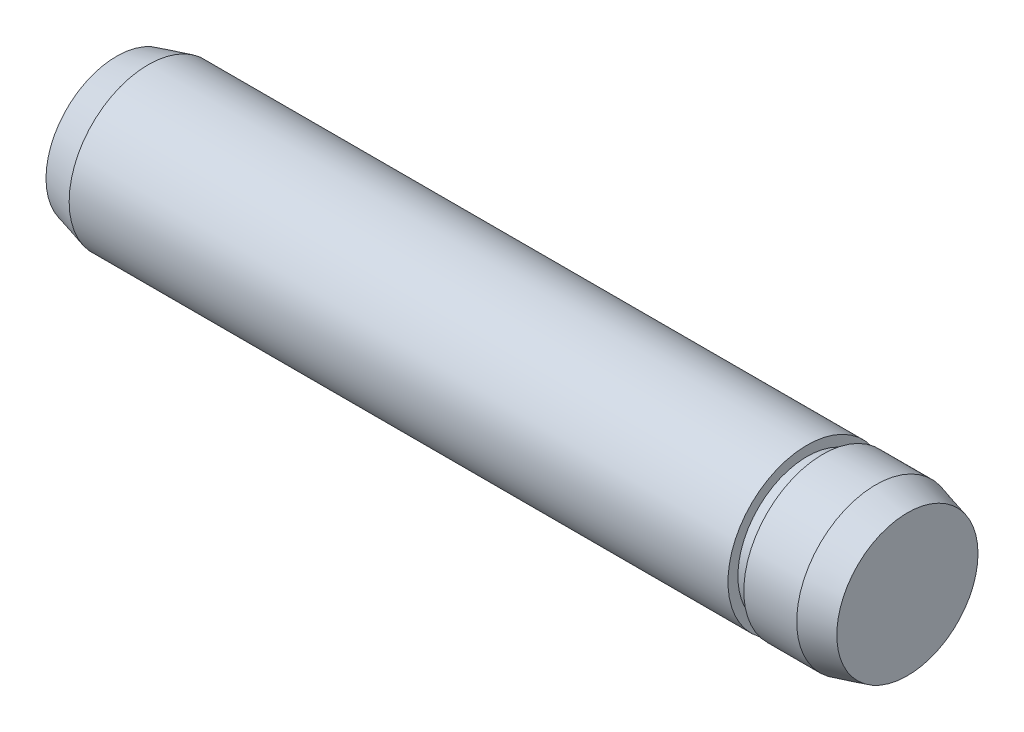
ISO-10303-21;
HEADER;
FILE_DESCRIPTION(('STEP AP214'),'2;1');
FILE_NAME('part.step','',(''),(''),'','','');
FILE_SCHEMA(('AUTOMOTIVE_DESIGN { 1 0 10303 214 1 1 1 1 }'));
ENDSEC;
DATA;
#1=APPLICATION_CONTEXT('core data for automotive mechanical design processes');
#2=APPLICATION_PROTOCOL_DEFINITION('international standard','automotive_design',2000,#1);
#3=PRODUCT_CONTEXT('',#1,'mechanical');
#4=PRODUCT('Part','Part','',(#3));
#5=PRODUCT_RELATED_PRODUCT_CATEGORY('part','',(#4));
#6=PRODUCT_DEFINITION_FORMATION('','',#4);
#7=PRODUCT_DEFINITION_CONTEXT('part definition',#1,'design');
#8=PRODUCT_DEFINITION('design','',#6,#7);
#9=PRODUCT_DEFINITION_SHAPE('','',#8);
#10=(LENGTH_UNIT() NAMED_UNIT(*) SI_UNIT(.MILLI.,.METRE.));
#11=(NAMED_UNIT(*) PLANE_ANGLE_UNIT() SI_UNIT($,.RADIAN.));
#12=(NAMED_UNIT(*) SI_UNIT($,.STERADIAN.) SOLID_ANGLE_UNIT());
#13=UNCERTAINTY_MEASURE_WITH_UNIT(LENGTH_MEASURE(1.E-05),#10,'distance_accuracy_value','');
#14=(GEOMETRIC_REPRESENTATION_CONTEXT(3) GLOBAL_UNCERTAINTY_ASSIGNED_CONTEXT((#13)) GLOBAL_UNIT_ASSIGNED_CONTEXT((#10,
#11,#12)) REPRESENTATION_CONTEXT('',''));
#15=CARTESIAN_POINT('',(0.,0.,0.));
#16=DIRECTION('',(0.,0.,1.));
#17=DIRECTION('',(1.,0.,0.));
#18=AXIS2_PLACEMENT_3D('',#15,#16,#17);
#19=CARTESIAN_POINT('',(-18.4,0.,0.));
#20=DIRECTION('',(1.,0.,0.));
#21=DIRECTION('',(0.,0.,-1.));
#22=AXIS2_PLACEMENT_3D('',#19,#20,#21);
#23=CYLINDRICAL_SURFACE('',#22,4.);
#24=CARTESIAN_POINT('',(15.72499999,0.,0.));
#25=DIRECTION('',(1.,0.,0.));
#26=DIRECTION('',(0.,0.,-1.));
#27=AXIS2_PLACEMENT_3D('',#24,#25,#26);
#28=CIRCLE('',#27,4.);
#29=CARTESIAN_POINT('',(15.72499999,0.,-4.));
#30=VERTEX_POINT('',#29);
#31=EDGE_CURVE('E64',#30,#30,#28,.T.);
#32=ORIENTED_EDGE('',*,*,#31,.T.);
#33=EDGE_LOOP('',(#32));
#34=FACE_BOUND('',#33,.T.);
#35=CARTESIAN_POINT('',(18.4,0.,0.));
#36=DIRECTION('',(1.,0.,0.));
#37=DIRECTION('',(0.,0.,-1.));
#38=AXIS2_PLACEMENT_3D('',#35,#36,#37);
#39=CIRCLE('',#38,4.);
#40=CARTESIAN_POINT('',(18.4,0.,-4.));
#41=VERTEX_POINT('',#40);
#42=EDGE_CURVE('E10',#41,#41,#39,.T.);
#43=ORIENTED_EDGE('',*,*,#42,.F.);
#44=EDGE_LOOP('',(#43));
#45=FACE_BOUND('',#44,.T.);
#46=ADVANCED_FACE('F38',(#34,#45),#23,.T.);
#47=CARTESIAN_POINT('',(18.4,0.,0.));
#48=DIRECTION('',(-1.,0.,0.));
#49=DIRECTION('',(0.,0.,-1.));
#50=AXIS2_PLACEMENT_3D('',#47,#48,#49);
#51=CONICAL_SURFACE('',#50,4.,0.26179938779915);
#52=CARTESIAN_POINT('',(20.,0.,0.));
#53=DIRECTION('',(1.,0.,0.));
#54=DIRECTION('',(0.,0.,-1.));
#55=AXIS2_PLACEMENT_3D('',#52,#53,#54);
#56=CIRCLE('',#55,3.5712812921102);
#57=CARTESIAN_POINT('',(20.,0.,-3.5712812921102));
#58=VERTEX_POINT('',#57);
#59=EDGE_CURVE('E45',#58,#58,#56,.T.);
#60=ORIENTED_EDGE('',*,*,#59,.F.);
#61=EDGE_LOOP('',(#60));
#62=FACE_BOUND('',#61,.T.);
#63=ORIENTED_EDGE('',*,*,#42,.T.);
#64=EDGE_LOOP('',(#63));
#65=FACE_BOUND('',#64,.T.);
#66=ADVANCED_FACE('F99',(#62,#65),#51,.T.);
#67=CARTESIAN_POINT('',(20.,0.,0.));
#68=DIRECTION('',(1.,0.,0.));
#69=DIRECTION('',(0.,0.,-1.));
#70=AXIS2_PLACEMENT_3D('',#67,#68,#69);
#71=PLANE('',#70);
#72=ORIENTED_EDGE('',*,*,#59,.T.);
#73=EDGE_LOOP('',(#72));
#74=FACE_BOUND('',#73,.T.);
#75=ADVANCED_FACE('F94',(#74),#71,.T.);
#76=CARTESIAN_POINT('',(15.72499999,0.,0.));
#77=DIRECTION('',(1.,0.,0.));
#78=DIRECTION('',(0.,0.,-1.));
#79=AXIS2_PLACEMENT_3D('',#76,#77,#78);
#80=PLANE('',#79);
#81=ORIENTED_EDGE('',*,*,#31,.F.);
#82=EDGE_LOOP('',(#81));
#83=FACE_BOUND('',#82,.T.);
#84=CARTESIAN_POINT('',(15.72499999,0.,0.));
#85=DIRECTION('',(1.,0.,0.));
#86=DIRECTION('',(0.,0.,-1.));
#87=AXIS2_PLACEMENT_3D('',#84,#85,#86);
#88=CIRCLE('',#87,3.5);
#89=CARTESIAN_POINT('',(15.72499999,0.,-3.5));
#90=VERTEX_POINT('',#89);
#91=EDGE_CURVE('E68',#90,#90,#88,.T.);
#92=ORIENTED_EDGE('',*,*,#91,.T.);
#93=EDGE_LOOP('',(#92));
#94=FACE_BOUND('',#93,.T.);
#95=ADVANCED_FACE('F78',(#83,#94),#80,.F.);
#96=CARTESIAN_POINT('',(14.92499999,0.,0.));
#97=DIRECTION('',(1.,0.,0.));
#98=DIRECTION('',(0.,0.,-1.));
#99=AXIS2_PLACEMENT_3D('',#96,#97,#98);
#100=PLANE('',#99);
#101=CARTESIAN_POINT('',(14.92499999,0.,0.));
#102=DIRECTION('',(1.,0.,0.));
#103=DIRECTION('',(0.,0.,-1.));
#104=AXIS2_PLACEMENT_3D('',#101,#102,#103);
#105=CIRCLE('',#104,4.);
#106=CARTESIAN_POINT('',(14.92499999,0.,-4.));
#107=VERTEX_POINT('',#106);
#108=EDGE_CURVE('E65',#107,#107,#105,.T.);
#109=ORIENTED_EDGE('',*,*,#108,.T.);
#110=EDGE_LOOP('',(#109));
#111=FACE_BOUND('',#110,.T.);
#112=CARTESIAN_POINT('',(14.92499999,0.,0.));
#113=DIRECTION('',(1.,0.,0.));
#114=DIRECTION('',(0.,0.,-1.));
#115=AXIS2_PLACEMENT_3D('',#112,#113,#114);
#116=CIRCLE('',#115,3.5);
#117=CARTESIAN_POINT('',(14.92499999,0.,-3.5));
#118=VERTEX_POINT('',#117);
#119=EDGE_CURVE('E72',#118,#118,#116,.T.);
#120=ORIENTED_EDGE('',*,*,#119,.F.);
#121=EDGE_LOOP('',(#120));
#122=FACE_BOUND('',#121,.T.);
#123=ADVANCED_FACE('F84',(#111,#122),#100,.T.);
#124=CARTESIAN_POINT('',(15.72499999,0.,0.));
#125=DIRECTION('',(-1.,0.,0.));
#126=DIRECTION('',(0.,0.,1.));
#127=AXIS2_PLACEMENT_3D('',#124,#125,#126);
#128=CYLINDRICAL_SURFACE('',#127,3.5);
#129=ORIENTED_EDGE('',*,*,#91,.F.);
#130=EDGE_LOOP('',(#129));
#131=FACE_BOUND('',#130,.T.);
#132=ORIENTED_EDGE('',*,*,#119,.T.);
#133=EDGE_LOOP('',(#132));
#134=FACE_BOUND('',#133,.T.);
#135=ADVANCED_FACE('F80',(#131,#134),#128,.T.);
#136=CARTESIAN_POINT('',(-20.,0.,0.));
#137=DIRECTION('',(-1.,0.,0.));
#138=DIRECTION('',(0.,0.,1.));
#139=AXIS2_PLACEMENT_3D('',#136,#137,#138);
#140=PLANE('',#139);
#141=CARTESIAN_POINT('',(-20.,0.,0.));
#142=DIRECTION('',(-1.,0.,0.));
#143=DIRECTION('',(0.,0.,1.));
#144=AXIS2_PLACEMENT_3D('',#141,#142,#143);
#145=CIRCLE('',#144,3.5712812921102);
#146=CARTESIAN_POINT('',(-20.,0.,3.5712812921102));
#147=VERTEX_POINT('',#146);
#148=EDGE_CURVE('E52',#147,#147,#145,.T.);
#149=ORIENTED_EDGE('',*,*,#148,.T.);
#150=EDGE_LOOP('',(#149));
#151=FACE_BOUND('',#150,.T.);
#152=ADVANCED_FACE('F83',(#151),#140,.T.);
#153=CARTESIAN_POINT('',(-18.4,0.,0.));
#154=DIRECTION('',(1.,0.,0.));
#155=DIRECTION('',(0.,0.,1.));
#156=AXIS2_PLACEMENT_3D('',#153,#154,#155);
#157=CONICAL_SURFACE('',#156,4.,0.26179938779915);
#158=ORIENTED_EDGE('',*,*,#148,.F.);
#159=EDGE_LOOP('',(#158));
#160=FACE_BOUND('',#159,.T.);
#161=CARTESIAN_POINT('',(-18.4,0.,0.));
#162=DIRECTION('',(-1.,0.,0.));
#163=DIRECTION('',(0.,0.,1.));
#164=AXIS2_PLACEMENT_3D('',#161,#162,#163);
#165=CIRCLE('',#164,4.);
#166=CARTESIAN_POINT('',(-18.4,0.,4.));
#167=VERTEX_POINT('',#166);
#168=EDGE_CURVE('E59',#167,#167,#165,.T.);
#169=ORIENTED_EDGE('',*,*,#168,.T.);
#170=EDGE_LOOP('',(#169));
#171=FACE_BOUND('',#170,.T.);
#172=ADVANCED_FACE('F108',(#160,#171),#157,.T.);
#173=ORIENTED_EDGE('',*,*,#168,.F.);
#174=EDGE_LOOP('',(#173));
#175=FACE_BOUND('',#174,.T.);
#176=ORIENTED_EDGE('',*,*,#108,.F.);
#177=EDGE_LOOP('',(#176));
#178=FACE_BOUND('',#177,.T.);
#179=ADVANCED_FACE('F101',(#175,#178),#23,.T.);
#180=CLOSED_SHELL('',(#46,#66,#75,#95,#123,#135,#152,#172,#179));
#181=MANIFOLD_SOLID_BREP('B2',#180);
#182=ADVANCED_BREP_SHAPE_REPRESENTATION('',(#18,#181),#14);
#183=SHAPE_DEFINITION_REPRESENTATION(#9,#182);
ENDSEC;
END-ISO-10303-21;
